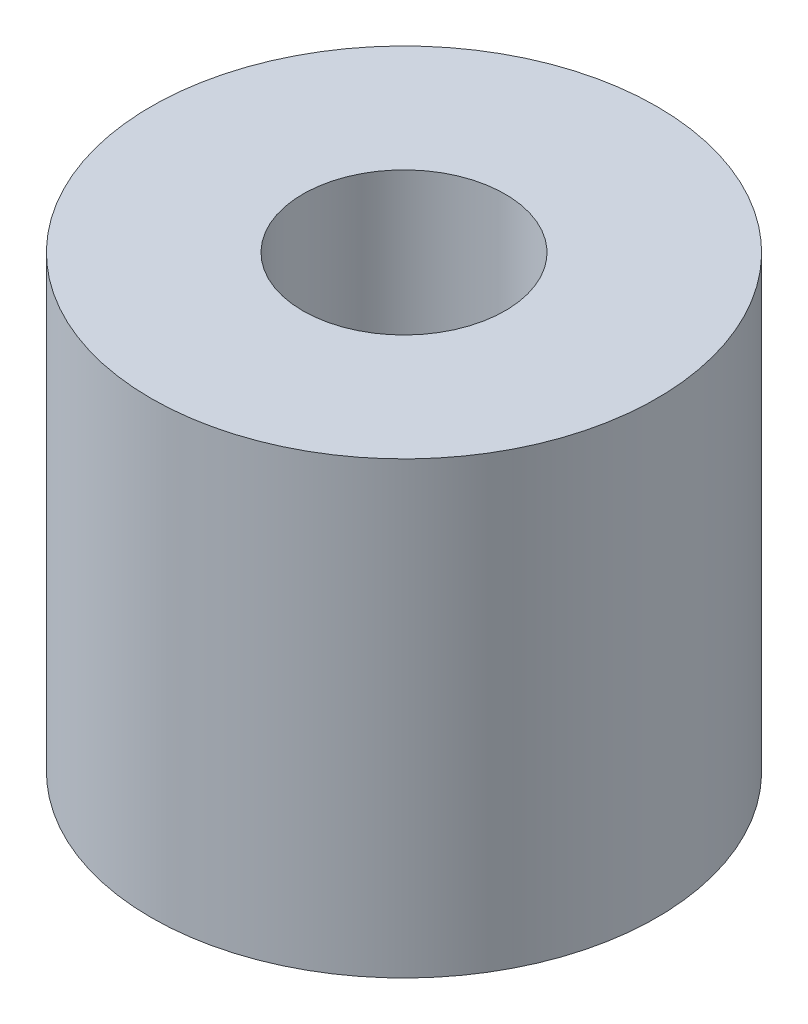
ISO-10303-21;
HEADER;
FILE_DESCRIPTION(('STEP AP214'),'2;1');
FILE_NAME('part.step','',(''),(''),'','','');
FILE_SCHEMA(('AUTOMOTIVE_DESIGN { 1 0 10303 214 1 1 1 1 }'));
ENDSEC;
DATA;
#1=APPLICATION_CONTEXT('core data for automotive mechanical design processes');
#2=APPLICATION_PROTOCOL_DEFINITION('international standard','automotive_design',2000,#1);
#3=PRODUCT_CONTEXT('',#1,'mechanical');
#4=PRODUCT('Part','Part','',(#3));
#5=PRODUCT_RELATED_PRODUCT_CATEGORY('part','',(#4));
#6=PRODUCT_DEFINITION_FORMATION('','',#4);
#7=PRODUCT_DEFINITION_CONTEXT('part definition',#1,'design');
#8=PRODUCT_DEFINITION('design','',#6,#7);
#9=PRODUCT_DEFINITION_SHAPE('','',#8);
#10=(LENGTH_UNIT() NAMED_UNIT(*) SI_UNIT(.MILLI.,.METRE.));
#11=(NAMED_UNIT(*) PLANE_ANGLE_UNIT() SI_UNIT($,.RADIAN.));
#12=(NAMED_UNIT(*) SI_UNIT($,.STERADIAN.) SOLID_ANGLE_UNIT());
#13=UNCERTAINTY_MEASURE_WITH_UNIT(LENGTH_MEASURE(1.E-05),#10,'distance_accuracy_value','');
#14=(GEOMETRIC_REPRESENTATION_CONTEXT(3) GLOBAL_UNCERTAINTY_ASSIGNED_CONTEXT((#13)) GLOBAL_UNIT_ASSIGNED_CONTEXT((#10,
#11,#12)) REPRESENTATION_CONTEXT('',''));
#15=CARTESIAN_POINT('',(0.,0.,0.));
#16=DIRECTION('',(0.,0.,1.));
#17=DIRECTION('',(1.,0.,0.));
#18=AXIS2_PLACEMENT_3D('',#15,#16,#17);
#19=CARTESIAN_POINT('',(0.,8.,0.));
#20=DIRECTION('',(0.,1.,0.));
#21=DIRECTION('',(0.,0.,1.));
#22=AXIS2_PLACEMENT_3D('',#19,#20,#21);
#23=PLANE('',#22);
#24=CARTESIAN_POINT('',(0.,8.,0.));
#25=DIRECTION('',(0.,1.,0.));
#26=DIRECTION('',(0.,0.,1.));
#27=AXIS2_PLACEMENT_3D('',#24,#25,#26);
#28=CIRCLE('',#27,4.5);
#29=CARTESIAN_POINT('',(0.,8.,4.5));
#30=VERTEX_POINT('',#29);
#31=EDGE_CURVE('E10',#30,#30,#28,.T.);
#32=ORIENTED_EDGE('',*,*,#31,.T.);
#33=EDGE_LOOP('',(#32));
#34=FACE_BOUND('',#33,.T.);
#35=CARTESIAN_POINT('',(0.,8.,0.));
#36=DIRECTION('',(0.,1.,0.));
#37=DIRECTION('',(0.,0.,1.));
#38=AXIS2_PLACEMENT_3D('',#35,#36,#37);
#39=CIRCLE('',#38,1.8);
#40=CARTESIAN_POINT('',(0.,8.,1.8));
#41=VERTEX_POINT('',#40);
#42=EDGE_CURVE('E43',#41,#41,#39,.T.);
#43=ORIENTED_EDGE('',*,*,#42,.F.);
#44=EDGE_LOOP('',(#43));
#45=FACE_BOUND('',#44,.T.);
#46=ADVANCED_FACE('F32',(#34,#45),#23,.T.);
#47=CARTESIAN_POINT('',(0.,0.,0.));
#48=DIRECTION('',(0.,1.,0.));
#49=DIRECTION('',(0.,0.,1.));
#50=AXIS2_PLACEMENT_3D('',#47,#48,#49);
#51=PLANE('',#50);
#52=CARTESIAN_POINT('',(0.,0.,0.));
#53=DIRECTION('',(0.,1.,0.));
#54=DIRECTION('',(0.,0.,1.));
#55=AXIS2_PLACEMENT_3D('',#52,#53,#54);
#56=CIRCLE('',#55,4.5);
#57=CARTESIAN_POINT('',(0.,0.,4.5));
#58=VERTEX_POINT('',#57);
#59=EDGE_CURVE('E36',#58,#58,#56,.T.);
#60=ORIENTED_EDGE('',*,*,#59,.F.);
#61=EDGE_LOOP('',(#60));
#62=FACE_BOUND('',#61,.T.);
#63=CARTESIAN_POINT('',(0.,0.,0.));
#64=DIRECTION('',(0.,1.,0.));
#65=DIRECTION('',(0.,0.,1.));
#66=AXIS2_PLACEMENT_3D('',#63,#64,#65);
#67=CIRCLE('',#66,1.8);
#68=CARTESIAN_POINT('',(0.,0.,1.8));
#69=VERTEX_POINT('',#68);
#70=EDGE_CURVE('E45',#69,#69,#67,.T.);
#71=ORIENTED_EDGE('',*,*,#70,.T.);
#72=EDGE_LOOP('',(#71));
#73=FACE_BOUND('',#72,.T.);
#74=ADVANCED_FACE('F55',(#62,#73),#51,.F.);
#75=CARTESIAN_POINT('',(0.,8.,0.));
#76=DIRECTION('',(0.,-1.,0.));
#77=DIRECTION('',(0.,0.,-1.));
#78=AXIS2_PLACEMENT_3D('',#75,#76,#77);
#79=CYLINDRICAL_SURFACE('',#78,4.5);
#80=ORIENTED_EDGE('',*,*,#31,.F.);
#81=EDGE_LOOP('',(#80));
#82=FACE_BOUND('',#81,.T.);
#83=ORIENTED_EDGE('',*,*,#59,.T.);
#84=EDGE_LOOP('',(#83));
#85=FACE_BOUND('',#84,.T.);
#86=ADVANCED_FACE('F34',(#82,#85),#79,.T.);
#87=CARTESIAN_POINT('',(0.,8.,0.));
#88=DIRECTION('',(0.,-1.,0.));
#89=DIRECTION('',(0.,0.,-1.));
#90=AXIS2_PLACEMENT_3D('',#87,#88,#89);
#91=CYLINDRICAL_SURFACE('',#90,1.8);
#92=ORIENTED_EDGE('',*,*,#42,.T.);
#93=EDGE_LOOP('',(#92));
#94=FACE_BOUND('',#93,.T.);
#95=ORIENTED_EDGE('',*,*,#70,.F.);
#96=EDGE_LOOP('',(#95));
#97=FACE_BOUND('',#96,.T.);
#98=ADVANCED_FACE('F51',(#94,#97),#91,.F.);
#99=CLOSED_SHELL('',(#46,#74,#86,#98));
#100=MANIFOLD_SOLID_BREP('B2',#99);
#101=ADVANCED_BREP_SHAPE_REPRESENTATION('',(#18,#100),#14);
#102=SHAPE_DEFINITION_REPRESENTATION(#9,#101);
ENDSEC;
END-ISO-10303-21;
